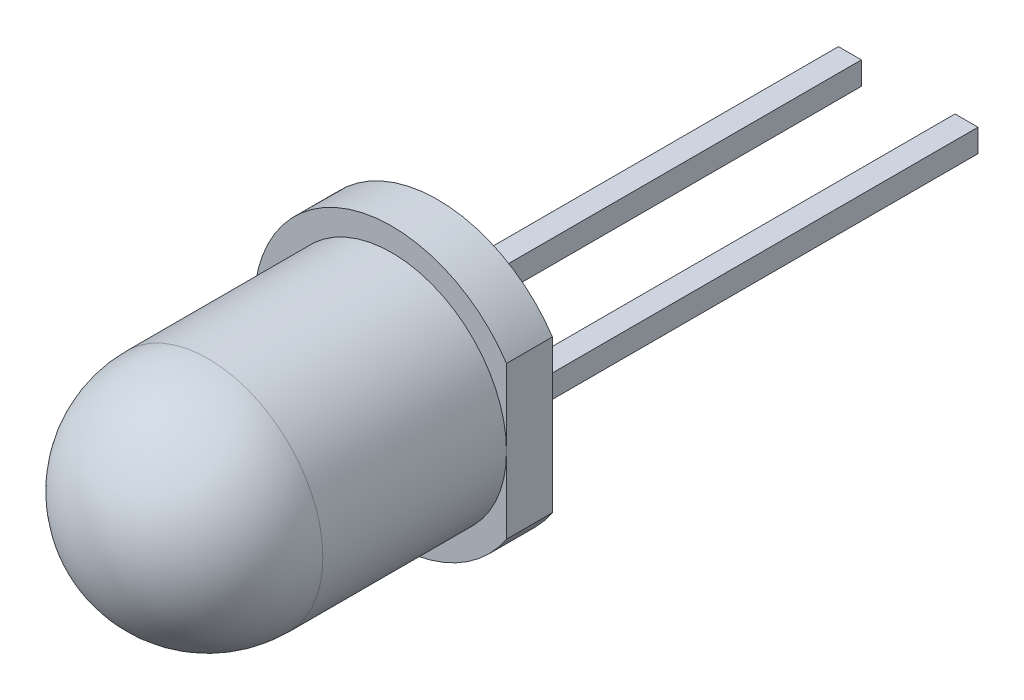
ISO-10303-21;
HEADER;
FILE_DESCRIPTION(('STEP AP214'),'2;1');
FILE_NAME('part.step','',(''),(''),'','','');
FILE_SCHEMA(('AUTOMOTIVE_DESIGN { 1 0 10303 214 1 1 1 1 }'));
ENDSEC;
DATA;
#1=APPLICATION_CONTEXT('core data for automotive mechanical design processes');
#2=APPLICATION_PROTOCOL_DEFINITION('international standard','automotive_design',2000,#1);
#3=PRODUCT_CONTEXT('',#1,'mechanical');
#4=PRODUCT('Part','Part','',(#3));
#5=PRODUCT_RELATED_PRODUCT_CATEGORY('part','',(#4));
#6=PRODUCT_DEFINITION_FORMATION('','',#4);
#7=PRODUCT_DEFINITION_CONTEXT('part definition',#1,'design');
#8=PRODUCT_DEFINITION('design','',#6,#7);
#9=PRODUCT_DEFINITION_SHAPE('','',#8);
#10=(LENGTH_UNIT() NAMED_UNIT(*) SI_UNIT(.MILLI.,.METRE.));
#11=(NAMED_UNIT(*) PLANE_ANGLE_UNIT() SI_UNIT($,.RADIAN.));
#12=(NAMED_UNIT(*) SI_UNIT($,.STERADIAN.) SOLID_ANGLE_UNIT());
#13=UNCERTAINTY_MEASURE_WITH_UNIT(LENGTH_MEASURE(1.E-05),#10,'distance_accuracy_value','');
#14=(GEOMETRIC_REPRESENTATION_CONTEXT(3) GLOBAL_UNCERTAINTY_ASSIGNED_CONTEXT((#13)) GLOBAL_UNIT_ASSIGNED_CONTEXT((#10,
#11,#12)) REPRESENTATION_CONTEXT('',''));
#15=CARTESIAN_POINT('',(0.,0.,0.));
#16=DIRECTION('',(0.,0.,1.));
#17=DIRECTION('',(1.,0.,0.));
#18=AXIS2_PLACEMENT_3D('',#15,#16,#17);
#19=CARTESIAN_POINT('',(1.77,0.25,0.));
#20=DIRECTION('',(-1.,0.,0.));
#21=DIRECTION('',(0.,-1.,0.));
#22=AXIS2_PLACEMENT_3D('',#19,#20,#21);
#23=PLANE('',#22);
#24=DIRECTION('',(0.,0.,-1.));
#25=VECTOR('',#24,1.);
#26=CARTESIAN_POINT('',(1.77,-0.25,0.));
#27=LINE('',#26,#25);
#28=CARTESIAN_POINT('',(1.77,-0.25,0.));
#29=VERTEX_POINT('',#28);
#30=CARTESIAN_POINT('',(1.77,-0.25,-10.));
#31=VERTEX_POINT('',#30);
#32=EDGE_CURVE('E110',#29,#31,#27,.T.);
#33=ORIENTED_EDGE('',*,*,#32,.T.);
#34=DIRECTION('',(0.,-1.,0.));
#35=VECTOR('',#34,1.);
#36=CARTESIAN_POINT('',(1.77,0.25,-10.));
#37=LINE('',#36,#35);
#38=CARTESIAN_POINT('',(1.77,0.25,-10.));
#39=VERTEX_POINT('',#38);
#40=EDGE_CURVE('E12',#39,#31,#37,.T.);
#41=ORIENTED_EDGE('',*,*,#40,.F.);
#42=DIRECTION('',(0.,0.,-1.));
#43=VECTOR('',#42,1.);
#44=CARTESIAN_POINT('',(1.77,0.25,0.));
#45=LINE('',#44,#43);
#46=CARTESIAN_POINT('',(1.77,0.25,0.));
#47=VERTEX_POINT('',#46);
#48=EDGE_CURVE('E87',#47,#39,#45,.T.);
#49=ORIENTED_EDGE('',*,*,#48,.F.);
#50=DIRECTION('',(0.,-1.,0.));
#51=VECTOR('',#50,1.);
#52=CARTESIAN_POINT('',(1.77,0.25,0.));
#53=LINE('',#52,#51);
#54=EDGE_CURVE('E63',#47,#29,#53,.T.);
#55=ORIENTED_EDGE('',*,*,#54,.T.);
#56=EDGE_LOOP('',(#33,#41,#49,#55));
#57=FACE_BOUND('',#56,.T.);
#58=ADVANCED_FACE('F47',(#57),#23,.F.);
#59=CARTESIAN_POINT('',(1.27,0.25,-10.));
#60=DIRECTION('',(0.,0.,-1.));
#61=DIRECTION('',(-1.,0.,0.));
#62=AXIS2_PLACEMENT_3D('',#59,#60,#61);
#63=PLANE('',#62);
#64=DIRECTION('',(1.,0.,0.));
#65=VECTOR('',#64,1.);
#66=CARTESIAN_POINT('',(1.27,-0.25,-10.));
#67=LINE('',#66,#65);
#68=CARTESIAN_POINT('',(1.27,-0.25,-10.));
#69=VERTEX_POINT('',#68);
#70=EDGE_CURVE('E96',#69,#31,#67,.T.);
#71=ORIENTED_EDGE('',*,*,#70,.F.);
#72=DIRECTION('',(0.,-1.,0.));
#73=VECTOR('',#72,1.);
#74=CARTESIAN_POINT('',(1.27,0.25,-10.));
#75=LINE('',#74,#73);
#76=CARTESIAN_POINT('',(1.27,0.25,-10.));
#77=VERTEX_POINT('',#76);
#78=EDGE_CURVE('E55',#77,#69,#75,.T.);
#79=ORIENTED_EDGE('',*,*,#78,.F.);
#80=DIRECTION('',(1.,0.,0.));
#81=VECTOR('',#80,1.);
#82=CARTESIAN_POINT('',(1.27,0.25,-10.));
#83=LINE('',#82,#81);
#84=EDGE_CURVE('E94',#77,#39,#83,.T.);
#85=ORIENTED_EDGE('',*,*,#84,.T.);
#86=ORIENTED_EDGE('',*,*,#40,.T.);
#87=EDGE_LOOP('',(#71,#79,#85,#86));
#88=FACE_BOUND('',#87,.T.);
#89=ADVANCED_FACE('F93',(#88),#63,.T.);
#90=CARTESIAN_POINT('',(1.27,0.25,0.));
#91=DIRECTION('',(-1.,0.,0.));
#92=DIRECTION('',(0.,-1.,0.));
#93=AXIS2_PLACEMENT_3D('',#90,#91,#92);
#94=PLANE('',#93);
#95=DIRECTION('',(0.,0.,-1.));
#96=VECTOR('',#95,1.);
#97=CARTESIAN_POINT('',(1.27,-0.25,0.));
#98=LINE('',#97,#96);
#99=CARTESIAN_POINT('',(1.27,-0.25,0.));
#100=VERTEX_POINT('',#99);
#101=EDGE_CURVE('E113',#100,#69,#98,.T.);
#102=ORIENTED_EDGE('',*,*,#101,.F.);
#103=DIRECTION('',(0.,-1.,0.));
#104=VECTOR('',#103,1.);
#105=CARTESIAN_POINT('',(1.27,0.25,0.));
#106=LINE('',#105,#104);
#107=CARTESIAN_POINT('',(1.27,0.25,0.));
#108=VERTEX_POINT('',#107);
#109=EDGE_CURVE('E76',#108,#100,#106,.T.);
#110=ORIENTED_EDGE('',*,*,#109,.F.);
#111=DIRECTION('',(0.,0.,-1.));
#112=VECTOR('',#111,1.);
#113=CARTESIAN_POINT('',(1.27,0.25,0.));
#114=LINE('',#113,#112);
#115=EDGE_CURVE('E102',#108,#77,#114,.T.);
#116=ORIENTED_EDGE('',*,*,#115,.T.);
#117=ORIENTED_EDGE('',*,*,#78,.T.);
#118=EDGE_LOOP('',(#102,#110,#116,#117));
#119=FACE_BOUND('',#118,.T.);
#120=ADVANCED_FACE('F104',(#119),#94,.T.);
#121=CARTESIAN_POINT('',(1.77,0.25,0.));
#122=DIRECTION('',(0.,0.,1.));
#123=DIRECTION('',(1.,0.,0.));
#124=AXIS2_PLACEMENT_3D('',#121,#122,#123);
#125=PLANE('',#124);
#126=DIRECTION('',(-1.,0.,0.));
#127=VECTOR('',#126,1.);
#128=CARTESIAN_POINT('',(1.77,-0.25,0.));
#129=LINE('',#128,#127);
#130=EDGE_CURVE('E115',#29,#100,#129,.T.);
#131=ORIENTED_EDGE('',*,*,#130,.F.);
#132=ORIENTED_EDGE('',*,*,#54,.F.);
#133=DIRECTION('',(-1.,0.,0.));
#134=VECTOR('',#133,1.);
#135=CARTESIAN_POINT('',(1.77,0.25,0.));
#136=LINE('',#135,#134);
#137=EDGE_CURVE('E105',#47,#108,#136,.T.);
#138=ORIENTED_EDGE('',*,*,#137,.T.);
#139=ORIENTED_EDGE('',*,*,#109,.T.);
#140=EDGE_LOOP('',(#131,#132,#138,#139));
#141=FACE_BOUND('',#140,.T.);
#142=ADVANCED_FACE('F121',(#141),#125,.T.);
#143=CARTESIAN_POINT('',(0.,0.25,0.));
#144=DIRECTION('',(0.,-1.,0.));
#145=DIRECTION('',(-1.,0.,0.));
#146=AXIS2_PLACEMENT_3D('',#143,#144,#145);
#147=PLANE('',#146);
#148=ORIENTED_EDGE('',*,*,#48,.T.);
#149=ORIENTED_EDGE('',*,*,#84,.F.);
#150=ORIENTED_EDGE('',*,*,#115,.F.);
#151=ORIENTED_EDGE('',*,*,#137,.F.);
#152=EDGE_LOOP('',(#148,#149,#150,#151));
#153=FACE_BOUND('',#152,.T.);
#154=ADVANCED_FACE('F101',(#153),#147,.F.);
#155=CARTESIAN_POINT('',(0.,-0.25,0.));
#156=DIRECTION('',(0.,-1.,0.));
#157=DIRECTION('',(-1.,0.,0.));
#158=AXIS2_PLACEMENT_3D('',#155,#156,#157);
#159=PLANE('',#158);
#160=ORIENTED_EDGE('',*,*,#32,.F.);
#161=ORIENTED_EDGE('',*,*,#130,.T.);
#162=ORIENTED_EDGE('',*,*,#101,.T.);
#163=ORIENTED_EDGE('',*,*,#70,.T.);
#164=EDGE_LOOP('',(#160,#161,#162,#163));
#165=FACE_BOUND('',#164,.T.);
#166=ADVANCED_FACE('F120',(#165),#159,.T.);
#167=CLOSED_SHELL('',(#58,#89,#120,#142,#154,#166));
#168=MANIFOLD_SOLID_BREP('B2',#167);
#169=CARTESIAN_POINT('',(-0.77,0.25,0.));
#170=DIRECTION('',(-1.,0.,0.));
#171=DIRECTION('',(0.,-1.,0.));
#172=AXIS2_PLACEMENT_3D('',#169,#170,#171);
#173=PLANE('',#172);
#174=DIRECTION('',(0.,0.,-1.));
#175=VECTOR('',#174,1.);
#176=CARTESIAN_POINT('',(-0.77,-0.25,0.));
#177=LINE('',#176,#175);
#178=CARTESIAN_POINT('',(-0.77,-0.25,0.));
#179=VERTEX_POINT('',#178);
#180=CARTESIAN_POINT('',(-0.77,-0.25,-10.));
#181=VERTEX_POINT('',#180);
#182=EDGE_CURVE('E254',#179,#181,#177,.T.);
#183=ORIENTED_EDGE('',*,*,#182,.T.);
#184=DIRECTION('',(0.,-1.,0.));
#185=VECTOR('',#184,1.);
#186=CARTESIAN_POINT('',(-0.77,0.25,-10.));
#187=LINE('',#186,#185);
#188=CARTESIAN_POINT('',(-0.77,0.25,-10.));
#189=VERTEX_POINT('',#188);
#190=EDGE_CURVE('E45',#189,#181,#187,.T.);
#191=ORIENTED_EDGE('',*,*,#190,.F.);
#192=DIRECTION('',(0.,0.,-1.));
#193=VECTOR('',#192,1.);
#194=CARTESIAN_POINT('',(-0.77,0.25,0.));
#195=LINE('',#194,#193);
#196=CARTESIAN_POINT('',(-0.77,0.25,0.));
#197=VERTEX_POINT('',#196);
#198=EDGE_CURVE('E231',#197,#189,#195,.T.);
#199=ORIENTED_EDGE('',*,*,#198,.F.);
#200=DIRECTION('',(0.,-1.,0.));
#201=VECTOR('',#200,1.);
#202=CARTESIAN_POINT('',(-0.77,0.25,0.));
#203=LINE('',#202,#201);
#204=EDGE_CURVE('E207',#197,#179,#203,.T.);
#205=ORIENTED_EDGE('',*,*,#204,.T.);
#206=EDGE_LOOP('',(#183,#191,#199,#205));
#207=FACE_BOUND('',#206,.T.);
#208=ADVANCED_FACE('F191',(#207),#173,.F.);
#209=CARTESIAN_POINT('',(-1.27,0.25,-10.));
#210=DIRECTION('',(0.,0.,-1.));
#211=DIRECTION('',(-1.,0.,0.));
#212=AXIS2_PLACEMENT_3D('',#209,#210,#211);
#213=PLANE('',#212);
#214=DIRECTION('',(1.,0.,0.));
#215=VECTOR('',#214,1.);
#216=CARTESIAN_POINT('',(-1.27,-0.25,-10.));
#217=LINE('',#216,#215);
#218=CARTESIAN_POINT('',(-1.27,-0.25,-10.));
#219=VERTEX_POINT('',#218);
#220=EDGE_CURVE('E240',#219,#181,#217,.T.);
#221=ORIENTED_EDGE('',*,*,#220,.F.);
#222=DIRECTION('',(0.,-1.,0.));
#223=VECTOR('',#222,1.);
#224=CARTESIAN_POINT('',(-1.27,0.25,-10.));
#225=LINE('',#224,#223);
#226=CARTESIAN_POINT('',(-1.27,0.25,-10.));
#227=VERTEX_POINT('',#226);
#228=EDGE_CURVE('E199',#227,#219,#225,.T.);
#229=ORIENTED_EDGE('',*,*,#228,.F.);
#230=DIRECTION('',(1.,0.,0.));
#231=VECTOR('',#230,1.);
#232=CARTESIAN_POINT('',(-1.27,0.25,-10.));
#233=LINE('',#232,#231);
#234=EDGE_CURVE('E238',#227,#189,#233,.T.);
#235=ORIENTED_EDGE('',*,*,#234,.T.);
#236=ORIENTED_EDGE('',*,*,#190,.T.);
#237=EDGE_LOOP('',(#221,#229,#235,#236));
#238=FACE_BOUND('',#237,.T.);
#239=ADVANCED_FACE('F237',(#238),#213,.T.);
#240=CARTESIAN_POINT('',(-1.27,0.25,0.));
#241=DIRECTION('',(-1.,0.,0.));
#242=DIRECTION('',(0.,-1.,0.));
#243=AXIS2_PLACEMENT_3D('',#240,#241,#242);
#244=PLANE('',#243);
#245=DIRECTION('',(0.,0.,-1.));
#246=VECTOR('',#245,1.);
#247=CARTESIAN_POINT('',(-1.27,-0.25,0.));
#248=LINE('',#247,#246);
#249=CARTESIAN_POINT('',(-1.27,-0.25,0.));
#250=VERTEX_POINT('',#249);
#251=EDGE_CURVE('E257',#250,#219,#248,.T.);
#252=ORIENTED_EDGE('',*,*,#251,.F.);
#253=DIRECTION('',(0.,-1.,0.));
#254=VECTOR('',#253,1.);
#255=CARTESIAN_POINT('',(-1.27,0.25,0.));
#256=LINE('',#255,#254);
#257=CARTESIAN_POINT('',(-1.27,0.25,0.));
#258=VERTEX_POINT('',#257);
#259=EDGE_CURVE('E220',#258,#250,#256,.T.);
#260=ORIENTED_EDGE('',*,*,#259,.F.);
#261=DIRECTION('',(0.,0.,-1.));
#262=VECTOR('',#261,1.);
#263=CARTESIAN_POINT('',(-1.27,0.25,0.));
#264=LINE('',#263,#262);
#265=EDGE_CURVE('E246',#258,#227,#264,.T.);
#266=ORIENTED_EDGE('',*,*,#265,.T.);
#267=ORIENTED_EDGE('',*,*,#228,.T.);
#268=EDGE_LOOP('',(#252,#260,#266,#267));
#269=FACE_BOUND('',#268,.T.);
#270=ADVANCED_FACE('F248',(#269),#244,.T.);
#271=CARTESIAN_POINT('',(-0.77,0.25,0.));
#272=DIRECTION('',(0.,0.,1.));
#273=DIRECTION('',(1.,0.,0.));
#274=AXIS2_PLACEMENT_3D('',#271,#272,#273);
#275=PLANE('',#274);
#276=DIRECTION('',(-1.,0.,0.));
#277=VECTOR('',#276,1.);
#278=CARTESIAN_POINT('',(-0.77,-0.25,0.));
#279=LINE('',#278,#277);
#280=EDGE_CURVE('E259',#179,#250,#279,.T.);
#281=ORIENTED_EDGE('',*,*,#280,.F.);
#282=ORIENTED_EDGE('',*,*,#204,.F.);
#283=DIRECTION('',(-1.,0.,0.));
#284=VECTOR('',#283,1.);
#285=CARTESIAN_POINT('',(-0.77,0.25,0.));
#286=LINE('',#285,#284);
#287=EDGE_CURVE('E249',#197,#258,#286,.T.);
#288=ORIENTED_EDGE('',*,*,#287,.T.);
#289=ORIENTED_EDGE('',*,*,#259,.T.);
#290=EDGE_LOOP('',(#281,#282,#288,#289));
#291=FACE_BOUND('',#290,.T.);
#292=ADVANCED_FACE('F265',(#291),#275,.T.);
#293=CARTESIAN_POINT('',(0.,0.25,0.));
#294=DIRECTION('',(0.,-1.,0.));
#295=DIRECTION('',(-1.,0.,0.));
#296=AXIS2_PLACEMENT_3D('',#293,#294,#295);
#297=PLANE('',#296);
#298=ORIENTED_EDGE('',*,*,#198,.T.);
#299=ORIENTED_EDGE('',*,*,#234,.F.);
#300=ORIENTED_EDGE('',*,*,#265,.F.);
#301=ORIENTED_EDGE('',*,*,#287,.F.);
#302=EDGE_LOOP('',(#298,#299,#300,#301));
#303=FACE_BOUND('',#302,.T.);
#304=ADVANCED_FACE('F245',(#303),#297,.F.);
#305=CARTESIAN_POINT('',(0.,-0.25,0.));
#306=DIRECTION('',(0.,-1.,0.));
#307=DIRECTION('',(-1.,0.,0.));
#308=AXIS2_PLACEMENT_3D('',#305,#306,#307);
#309=PLANE('',#308);
#310=ORIENTED_EDGE('',*,*,#182,.F.);
#311=ORIENTED_EDGE('',*,*,#280,.T.);
#312=ORIENTED_EDGE('',*,*,#251,.T.);
#313=ORIENTED_EDGE('',*,*,#220,.T.);
#314=EDGE_LOOP('',(#310,#311,#312,#313));
#315=FACE_BOUND('',#314,.T.);
#316=ADVANCED_FACE('F264',(#315),#309,.T.);
#317=CLOSED_SHELL('',(#208,#239,#270,#292,#304,#316));
#318=MANIFOLD_SOLID_BREP('B6',#317);
#319=CARTESIAN_POINT('',(0.,0.,1.));
#320=DIRECTION('',(0.,0.,1.));
#321=DIRECTION('',(1.,0.,0.));
#322=AXIS2_PLACEMENT_3D('',#319,#320,#321);
#323=PLANE('',#322);
#324=DIRECTION('',(0.,-1.,0.));
#325=VECTOR('',#324,1.);
#326=CARTESIAN_POINT('',(2.5,1.85027574752907,1.));
#327=LINE('',#326,#325);
#328=CARTESIAN_POINT('',(2.5,1.6583123951777,1.));
#329=VERTEX_POINT('',#328);
#330=CARTESIAN_POINT('',(2.5,0.,1.));
#331=VERTEX_POINT('',#330);
#332=EDGE_CURVE('E349',#329,#331,#327,.T.);
#333=ORIENTED_EDGE('',*,*,#332,.F.);
#334=CARTESIAN_POINT('',(0.,0.,1.));
#335=DIRECTION('',(0.,0.,1.));
#336=DIRECTION('',(1.,0.,0.));
#337=AXIS2_PLACEMENT_3D('',#334,#335,#336);
#338=CIRCLE('',#337,3.);
#339=CARTESIAN_POINT('',(2.5,-1.6583123951777,1.));
#340=VERTEX_POINT('',#339);
#341=EDGE_CURVE('E189',#329,#340,#338,.T.);
#342=ORIENTED_EDGE('',*,*,#341,.T.);
#343=EDGE_CURVE('E369',#331,#340,#327,.T.);
#344=ORIENTED_EDGE('',*,*,#343,.F.);
#345=CARTESIAN_POINT('',(0.,0.,1.));
#346=DIRECTION('',(0.,0.,1.));
#347=DIRECTION('',(1.,0.,0.));
#348=AXIS2_PLACEMENT_3D('',#345,#346,#347);
#349=CIRCLE('',#348,2.5);
#350=EDGE_CURVE('E368',#331,#331,#349,.T.);
#351=ORIENTED_EDGE('',*,*,#350,.F.);
#352=EDGE_LOOP('',(#333,#342,#344,#351));
#353=FACE_BOUND('',#352,.T.);
#354=ADVANCED_FACE('F326',(#353),#323,.T.);
#355=CARTESIAN_POINT('',(0.,0.,1.));
#356=DIRECTION('',(0.,0.,-1.));
#357=DIRECTION('',(-1.,0.,0.));
#358=AXIS2_PLACEMENT_3D('',#355,#356,#357);
#359=CYLINDRICAL_SURFACE('',#358,3.);
#360=ORIENTED_EDGE('',*,*,#341,.F.);
#361=DIRECTION('',(0.,0.,-1.));
#362=VECTOR('',#361,1.);
#363=CARTESIAN_POINT('',(2.5,1.6583123951777,1.));
#364=LINE('',#363,#362);
#365=CARTESIAN_POINT('',(2.5,1.6583123951777,0.));
#366=VERTEX_POINT('',#365);
#367=EDGE_CURVE('E357',#366,#329,#364,.F.);
#368=ORIENTED_EDGE('',*,*,#367,.F.);
#369=CARTESIAN_POINT('',(0.,0.,0.));
#370=DIRECTION('',(0.,0.,1.));
#371=DIRECTION('',(1.,0.,0.));
#372=AXIS2_PLACEMENT_3D('',#369,#370,#371);
#373=CIRCLE('',#372,3.);
#374=CARTESIAN_POINT('',(2.5,-1.6583123951777,0.));
#375=VERTEX_POINT('',#374);
#376=EDGE_CURVE('E335',#366,#375,#373,.T.);
#377=ORIENTED_EDGE('',*,*,#376,.T.);
#378=DIRECTION('',(0.,0.,-1.));
#379=VECTOR('',#378,1.);
#380=CARTESIAN_POINT('',(2.5,-1.6583123951777,1.));
#381=LINE('',#380,#379);
#382=EDGE_CURVE('E343',#340,#375,#381,.T.);
#383=ORIENTED_EDGE('',*,*,#382,.F.);
#384=EDGE_LOOP('',(#360,#368,#377,#383));
#385=FACE_BOUND('',#384,.T.);
#386=ADVANCED_FACE('F371',(#385),#359,.T.);
#387=CARTESIAN_POINT('',(0.,0.,0.));
#388=DIRECTION('',(0.,0.,1.));
#389=DIRECTION('',(1.,0.,0.));
#390=AXIS2_PLACEMENT_3D('',#387,#388,#389);
#391=PLANE('',#390);
#392=ORIENTED_EDGE('',*,*,#376,.F.);
#393=DIRECTION('',(0.,1.,0.));
#394=VECTOR('',#393,1.);
#395=CARTESIAN_POINT('',(2.5,1.85027574752907,0.));
#396=LINE('',#395,#394);
#397=EDGE_CURVE('E359',#375,#366,#396,.T.);
#398=ORIENTED_EDGE('',*,*,#397,.F.);
#399=EDGE_LOOP('',(#392,#398));
#400=FACE_BOUND('',#399,.T.);
#401=ADVANCED_FACE('F382',(#400),#391,.F.);
#402=CARTESIAN_POINT('',(0.,0.,5.));
#403=DIRECTION('',(0.,0.,-1.));
#404=DIRECTION('',(-1.,0.,0.));
#405=AXIS2_PLACEMENT_3D('',#402,#403,#404);
#406=CYLINDRICAL_SURFACE('',#405,2.5);
#407=CARTESIAN_POINT('',(0.,0.,5.));
#408=DIRECTION('',(0.,0.,1.));
#409=DIRECTION('',(1.,0.,0.));
#410=AXIS2_PLACEMENT_3D('',#407,#408,#409);
#411=CIRCLE('',#410,2.5);
#412=CARTESIAN_POINT('',(2.5,0.,5.));
#413=VERTEX_POINT('',#412);
#414=EDGE_CURVE('E330',#413,#413,#411,.T.);
#415=ORIENTED_EDGE('',*,*,#414,.F.);
#416=EDGE_LOOP('',(#415));
#417=FACE_BOUND('',#416,.T.);
#418=ORIENTED_EDGE('',*,*,#350,.T.);
#419=EDGE_LOOP('',(#418));
#420=FACE_BOUND('',#419,.T.);
#421=ADVANCED_FACE('F379',(#417,#420),#406,.T.);
#422=CARTESIAN_POINT('',(0.,0.,5.));
#423=DIRECTION('',(0.,0.,1.));
#424=DIRECTION('',(1.,0.,0.));
#425=AXIS2_PLACEMENT_3D('',#422,#423,#424);
#426=SPHERICAL_SURFACE('',#425,2.5);
#427=ORIENTED_EDGE('',*,*,#414,.T.);
#428=EDGE_LOOP('',(#427));
#429=FACE_BOUND('',#428,.T.);
#430=ADVANCED_FACE('F328',(#429),#426,.T.);
#431=CARTESIAN_POINT('',(2.5,1.85027574752907,-0.000999999999999916));
#432=DIRECTION('',(-1.,0.,0.));
#433=DIRECTION('',(0.,-1.,0.));
#434=AXIS2_PLACEMENT_3D('',#431,#432,#433);
#435=PLANE('',#434);
#436=ORIENTED_EDGE('',*,*,#367,.T.);
#437=ORIENTED_EDGE('',*,*,#332,.T.);
#438=ORIENTED_EDGE('',*,*,#343,.T.);
#439=ORIENTED_EDGE('',*,*,#382,.T.);
#440=ORIENTED_EDGE('',*,*,#397,.T.);
#441=EDGE_LOOP('',(#436,#437,#438,#439,#440));
#442=FACE_BOUND('',#441,.T.);
#443=ADVANCED_FACE('F358',(#442),#435,.F.);
#444=CLOSED_SHELL('',(#354,#386,#401,#421,#430,#443));
#445=MANIFOLD_SOLID_BREP('B39',#444);
#446=ADVANCED_BREP_SHAPE_REPRESENTATION('',(#18,#168,#318,#445),#14);
#447=SHAPE_DEFINITION_REPRESENTATION(#9,#446);
ENDSEC;
END-ISO-10303-21;
